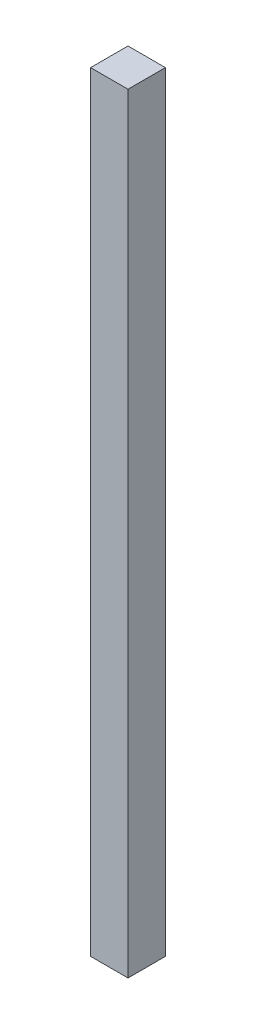
ISO-10303-21;
HEADER;
FILE_DESCRIPTION(('STEP AP214'),'2;1');
FILE_NAME('part.step','',(''),(''),'','','');
FILE_SCHEMA(('AUTOMOTIVE_DESIGN { 1 0 10303 214 1 1 1 1 }'));
ENDSEC;
DATA;
#1=APPLICATION_CONTEXT('core data for automotive mechanical design processes');
#2=APPLICATION_PROTOCOL_DEFINITION('international standard','automotive_design',2000,#1);
#3=PRODUCT_CONTEXT('',#1,'mechanical');
#4=PRODUCT('Part','Part','',(#3));
#5=PRODUCT_RELATED_PRODUCT_CATEGORY('part','',(#4));
#6=PRODUCT_DEFINITION_FORMATION('','',#4);
#7=PRODUCT_DEFINITION_CONTEXT('part definition',#1,'design');
#8=PRODUCT_DEFINITION('design','',#6,#7);
#9=PRODUCT_DEFINITION_SHAPE('','',#8);
#10=(LENGTH_UNIT() NAMED_UNIT(*) SI_UNIT(.MILLI.,.METRE.));
#11=(NAMED_UNIT(*) PLANE_ANGLE_UNIT() SI_UNIT($,.RADIAN.));
#12=(NAMED_UNIT(*) SI_UNIT($,.STERADIAN.) SOLID_ANGLE_UNIT());
#13=UNCERTAINTY_MEASURE_WITH_UNIT(LENGTH_MEASURE(1.E-05),#10,'distance_accuracy_value','');
#14=(GEOMETRIC_REPRESENTATION_CONTEXT(3) GLOBAL_UNCERTAINTY_ASSIGNED_CONTEXT((#13)) GLOBAL_UNIT_ASSIGNED_CONTEXT((#10,
#11,#12)) REPRESENTATION_CONTEXT('',''));
#15=CARTESIAN_POINT('',(0.,0.,0.));
#16=DIRECTION('',(0.,0.,1.));
#17=DIRECTION('',(1.,0.,0.));
#18=AXIS2_PLACEMENT_3D('',#15,#16,#17);
#19=CARTESIAN_POINT('',(0.,1828.8,0.));
#20=DIRECTION('',(-1.,0.,0.));
#21=DIRECTION('',(0.,0.,1.));
#22=AXIS2_PLACEMENT_3D('',#19,#20,#21);
#23=PLANE('',#22);
#24=DIRECTION('',(0.,0.,-1.));
#25=VECTOR('',#24,1.);
#26=CARTESIAN_POINT('',(0.,0.,0.));
#27=LINE('',#26,#25);
#28=CARTESIAN_POINT('',(0.,0.,0.));
#29=VERTEX_POINT('',#28);
#30=CARTESIAN_POINT('',(0.,0.,-88.9));
#31=VERTEX_POINT('',#30);
#32=EDGE_CURVE('E109',#29,#31,#27,.T.);
#33=ORIENTED_EDGE('',*,*,#32,.T.);
#34=DIRECTION('',(0.,-1.,0.));
#35=VECTOR('',#34,1.);
#36=CARTESIAN_POINT('',(0.,1828.8,-88.9));
#37=LINE('',#36,#35);
#38=CARTESIAN_POINT('',(0.,1828.8,-88.9));
#39=VERTEX_POINT('',#38);
#40=EDGE_CURVE('E11',#39,#31,#37,.T.);
#41=ORIENTED_EDGE('',*,*,#40,.F.);
#42=DIRECTION('',(0.,0.,-1.));
#43=VECTOR('',#42,1.);
#44=CARTESIAN_POINT('',(0.,1828.8,0.));
#45=LINE('',#44,#43);
#46=CARTESIAN_POINT('',(0.,1828.8,0.));
#47=VERTEX_POINT('',#46);
#48=EDGE_CURVE('E93',#47,#39,#45,.T.);
#49=ORIENTED_EDGE('',*,*,#48,.F.);
#50=DIRECTION('',(0.,-1.,0.));
#51=VECTOR('',#50,1.);
#52=CARTESIAN_POINT('',(0.,1828.8,0.));
#53=LINE('',#52,#51);
#54=EDGE_CURVE('E105',#47,#29,#53,.T.);
#55=ORIENTED_EDGE('',*,*,#54,.T.);
#56=EDGE_LOOP('',(#33,#41,#49,#55));
#57=FACE_BOUND('',#56,.T.);
#58=ADVANCED_FACE('F41',(#57),#23,.F.);
#59=CARTESIAN_POINT('',(0.,1828.8,-88.9));
#60=DIRECTION('',(0.,0.,1.));
#61=DIRECTION('',(1.,0.,0.));
#62=AXIS2_PLACEMENT_3D('',#59,#60,#61);
#63=PLANE('',#62);
#64=DIRECTION('',(-1.,0.,0.));
#65=VECTOR('',#64,1.);
#66=CARTESIAN_POINT('',(0.,0.,-88.9));
#67=LINE('',#66,#65);
#68=CARTESIAN_POINT('',(-88.9,0.,-88.9));
#69=VERTEX_POINT('',#68);
#70=EDGE_CURVE('E98',#31,#69,#67,.T.);
#71=ORIENTED_EDGE('',*,*,#70,.T.);
#72=DIRECTION('',(0.,-1.,0.));
#73=VECTOR('',#72,1.);
#74=CARTESIAN_POINT('',(-88.9,1828.8,-88.9));
#75=LINE('',#74,#73);
#76=CARTESIAN_POINT('',(-88.9,1828.8,-88.9));
#77=VERTEX_POINT('',#76);
#78=EDGE_CURVE('E50',#77,#69,#75,.T.);
#79=ORIENTED_EDGE('',*,*,#78,.F.);
#80=DIRECTION('',(-1.,0.,0.));
#81=VECTOR('',#80,1.);
#82=CARTESIAN_POINT('',(0.,1828.8,-88.9));
#83=LINE('',#82,#81);
#84=EDGE_CURVE('E88',#39,#77,#83,.T.);
#85=ORIENTED_EDGE('',*,*,#84,.F.);
#86=ORIENTED_EDGE('',*,*,#40,.T.);
#87=EDGE_LOOP('',(#71,#79,#85,#86));
#88=FACE_BOUND('',#87,.T.);
#89=ADVANCED_FACE('F97',(#88),#63,.F.);
#90=CARTESIAN_POINT('',(-88.9,1828.8,-88.9));
#91=DIRECTION('',(1.,0.,0.));
#92=DIRECTION('',(0.,0.,-1.));
#93=AXIS2_PLACEMENT_3D('',#90,#91,#92);
#94=PLANE('',#93);
#95=DIRECTION('',(0.,0.,1.));
#96=VECTOR('',#95,1.);
#97=CARTESIAN_POINT('',(-88.9,0.,-88.9));
#98=LINE('',#97,#96);
#99=CARTESIAN_POINT('',(-88.9,0.,0.));
#100=VERTEX_POINT('',#99);
#101=EDGE_CURVE('E75',#69,#100,#98,.T.);
#102=ORIENTED_EDGE('',*,*,#101,.T.);
#103=DIRECTION('',(0.,-1.,0.));
#104=VECTOR('',#103,1.);
#105=CARTESIAN_POINT('',(-88.9,1828.8,0.));
#106=LINE('',#105,#104);
#107=CARTESIAN_POINT('',(-88.9,1828.8,0.));
#108=VERTEX_POINT('',#107);
#109=EDGE_CURVE('E100',#108,#100,#106,.T.);
#110=ORIENTED_EDGE('',*,*,#109,.F.);
#111=DIRECTION('',(0.,0.,1.));
#112=VECTOR('',#111,1.);
#113=CARTESIAN_POINT('',(-88.9,1828.8,-88.9));
#114=LINE('',#113,#112);
#115=EDGE_CURVE('E91',#77,#108,#114,.T.);
#116=ORIENTED_EDGE('',*,*,#115,.F.);
#117=ORIENTED_EDGE('',*,*,#78,.T.);
#118=EDGE_LOOP('',(#102,#110,#116,#117));
#119=FACE_BOUND('',#118,.T.);
#120=ADVANCED_FACE('F101',(#119),#94,.F.);
#121=CARTESIAN_POINT('',(-88.9,1828.8,0.));
#122=DIRECTION('',(0.,0.,-1.));
#123=DIRECTION('',(-1.,0.,0.));
#124=AXIS2_PLACEMENT_3D('',#121,#122,#123);
#125=PLANE('',#124);
#126=DIRECTION('',(1.,0.,0.));
#127=VECTOR('',#126,1.);
#128=CARTESIAN_POINT('',(-88.9,0.,0.));
#129=LINE('',#128,#127);
#130=EDGE_CURVE('E81',#100,#29,#129,.T.);
#131=ORIENTED_EDGE('',*,*,#130,.T.);
#132=ORIENTED_EDGE('',*,*,#54,.F.);
#133=DIRECTION('',(1.,0.,0.));
#134=VECTOR('',#133,1.);
#135=CARTESIAN_POINT('',(-88.9,1828.8,0.));
#136=LINE('',#135,#134);
#137=EDGE_CURVE('E58',#108,#47,#136,.T.);
#138=ORIENTED_EDGE('',*,*,#137,.F.);
#139=ORIENTED_EDGE('',*,*,#109,.T.);
#140=EDGE_LOOP('',(#131,#132,#138,#139));
#141=FACE_BOUND('',#140,.T.);
#142=ADVANCED_FACE('F122',(#141),#125,.F.);
#143=CARTESIAN_POINT('',(0.,1828.8,0.));
#144=DIRECTION('',(0.,1.,0.));
#145=DIRECTION('',(0.,0.,1.));
#146=AXIS2_PLACEMENT_3D('',#143,#144,#145);
#147=PLANE('',#146);
#148=ORIENTED_EDGE('',*,*,#48,.T.);
#149=ORIENTED_EDGE('',*,*,#84,.T.);
#150=ORIENTED_EDGE('',*,*,#115,.T.);
#151=ORIENTED_EDGE('',*,*,#137,.T.);
#152=EDGE_LOOP('',(#148,#149,#150,#151));
#153=FACE_BOUND('',#152,.T.);
#154=ADVANCED_FACE('F89',(#153),#147,.T.);
#155=CARTESIAN_POINT('',(0.,0.,0.));
#156=DIRECTION('',(0.,1.,0.));
#157=DIRECTION('',(0.,0.,1.));
#158=AXIS2_PLACEMENT_3D('',#155,#156,#157);
#159=PLANE('',#158);
#160=ORIENTED_EDGE('',*,*,#32,.F.);
#161=ORIENTED_EDGE('',*,*,#130,.F.);
#162=ORIENTED_EDGE('',*,*,#101,.F.);
#163=ORIENTED_EDGE('',*,*,#70,.F.);
#164=EDGE_LOOP('',(#160,#161,#162,#163));
#165=FACE_BOUND('',#164,.T.);
#166=ADVANCED_FACE('F125',(#165),#159,.F.);
#167=CLOSED_SHELL('',(#58,#89,#120,#142,#154,#166));
#168=MANIFOLD_SOLID_BREP('B2',#167);
#169=ADVANCED_BREP_SHAPE_REPRESENTATION('',(#18,#168),#14);
#170=SHAPE_DEFINITION_REPRESENTATION(#9,#169);
ENDSEC;
END-ISO-10303-21;
